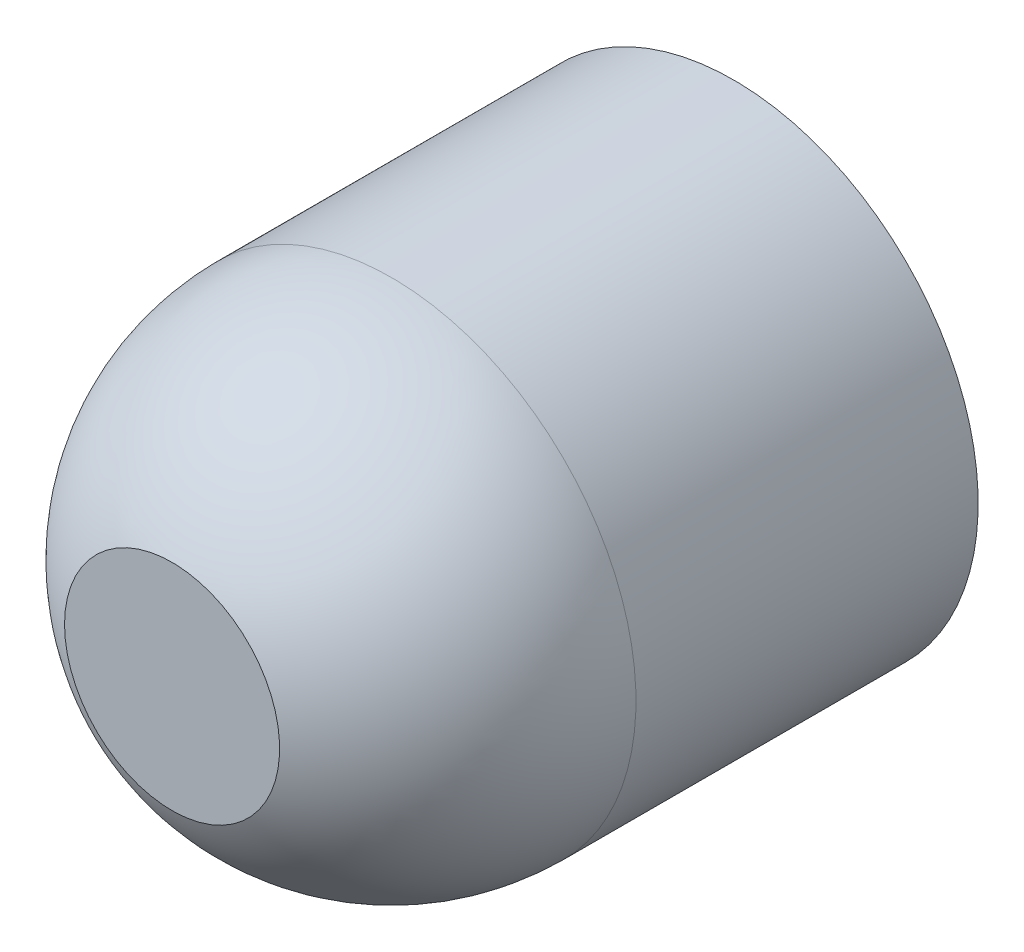
ISO-10303-21;
HEADER;
FILE_DESCRIPTION(('STEP AP214'),'2;1');
FILE_NAME('part.step','',(''),(''),'','','');
FILE_SCHEMA(('AUTOMOTIVE_DESIGN { 1 0 10303 214 1 1 1 1 }'));
ENDSEC;
DATA;
#1=APPLICATION_CONTEXT('core data for automotive mechanical design processes');
#2=APPLICATION_PROTOCOL_DEFINITION('international standard','automotive_design',2000,#1);
#3=PRODUCT_CONTEXT('',#1,'mechanical');
#4=PRODUCT('Part','Part','',(#3));
#5=PRODUCT_RELATED_PRODUCT_CATEGORY('part','',(#4));
#6=PRODUCT_DEFINITION_FORMATION('','',#4);
#7=PRODUCT_DEFINITION_CONTEXT('part definition',#1,'design');
#8=PRODUCT_DEFINITION('design','',#6,#7);
#9=PRODUCT_DEFINITION_SHAPE('','',#8);
#10=(LENGTH_UNIT() NAMED_UNIT(*) SI_UNIT(.MILLI.,.METRE.));
#11=(NAMED_UNIT(*) PLANE_ANGLE_UNIT() SI_UNIT($,.RADIAN.));
#12=(NAMED_UNIT(*) SI_UNIT($,.STERADIAN.) SOLID_ANGLE_UNIT());
#13=UNCERTAINTY_MEASURE_WITH_UNIT(LENGTH_MEASURE(1.E-05),#10,'distance_accuracy_value','');
#14=(GEOMETRIC_REPRESENTATION_CONTEXT(3) GLOBAL_UNCERTAINTY_ASSIGNED_CONTEXT((#13)) GLOBAL_UNIT_ASSIGNED_CONTEXT((#10,
#11,#12)) REPRESENTATION_CONTEXT('',''));
#15=CARTESIAN_POINT('',(0.,0.,0.));
#16=DIRECTION('',(0.,0.,1.));
#17=DIRECTION('',(1.,0.,0.));
#18=AXIS2_PLACEMENT_3D('',#15,#16,#17);
#19=CARTESIAN_POINT('',(0.,0.,0.));
#20=DIRECTION('',(0.,0.,1.));
#21=DIRECTION('',(1.,0.,0.));
#22=AXIS2_PLACEMENT_3D('',#19,#20,#21);
#23=PLANE('',#22);
#24=CARTESIAN_POINT('',(0.,0.,0.));
#25=DIRECTION('',(0.,0.,-1.));
#26=DIRECTION('',(-1.,0.,0.));
#27=AXIS2_PLACEMENT_3D('',#24,#25,#26);
#28=CIRCLE('',#27,12.5);
#29=CARTESIAN_POINT('',(-12.5,0.,0.));
#30=VERTEX_POINT('',#29);
#31=EDGE_CURVE('E35',#30,#30,#28,.T.);
#32=ORIENTED_EDGE('',*,*,#31,.T.);
#33=EDGE_LOOP('',(#32));
#34=FACE_BOUND('',#33,.T.);
#35=ADVANCED_FACE('F29',(#34),#23,.F.);
#36=CARTESIAN_POINT('',(0.,0.,0.));
#37=DIRECTION('',(0.,0.,-1.));
#38=DIRECTION('',(-1.,0.,0.));
#39=AXIS2_PLACEMENT_3D('',#36,#37,#38);
#40=CYLINDRICAL_SURFACE('',#39,12.5);
#41=ORIENTED_EDGE('',*,*,#31,.F.);
#42=EDGE_LOOP('',(#41));
#43=FACE_BOUND('',#42,.T.);
#44=CARTESIAN_POINT('',(0.,0.,17.5));
#45=DIRECTION('',(0.,0.,-1.));
#46=DIRECTION('',(-1.,0.,0.));
#47=AXIS2_PLACEMENT_3D('',#44,#45,#46);
#48=CIRCLE('',#47,12.5);
#49=CARTESIAN_POINT('',(-12.5,0.,17.5));
#50=VERTEX_POINT('',#49);
#51=EDGE_CURVE('E39',#50,#50,#48,.T.);
#52=ORIENTED_EDGE('',*,*,#51,.T.);
#53=EDGE_LOOP('',(#52));
#54=FACE_BOUND('',#53,.T.);
#55=ADVANCED_FACE('F46',(#43,#54),#40,.T.);
#56=CARTESIAN_POINT('',(0.,0.,17.5));
#57=DIRECTION('',(0.,0.,-1.));
#58=DIRECTION('',(-1.,0.,0.));
#59=AXIS2_PLACEMENT_3D('',#56,#57,#58);
#60=SPHERICAL_SURFACE('',#59,12.5);
#61=CARTESIAN_POINT('',(0.,0.,28.7249721603218));
#62=DIRECTION('',(0.,0.,-1.));
#63=DIRECTION('',(-1.,0.,0.));
#64=AXIS2_PLACEMENT_3D('',#61,#62,#63);
#65=CIRCLE('',#64,5.5);
#66=CARTESIAN_POINT('',(-5.5,0.,28.7249721603218));
#67=VERTEX_POINT('',#66);
#68=EDGE_CURVE('E10',#67,#67,#65,.T.);
#69=ORIENTED_EDGE('',*,*,#68,.T.);
#70=EDGE_LOOP('',(#69));
#71=FACE_BOUND('',#70,.T.);
#72=ORIENTED_EDGE('',*,*,#51,.F.);
#73=EDGE_LOOP('',(#72));
#74=FACE_BOUND('',#73,.T.);
#75=ADVANCED_FACE('F48',(#71,#74),#60,.T.);
#76=CARTESIAN_POINT('',(-5.5,-11.8,28.7249721603218));
#77=DIRECTION('',(0.,0.,-1.));
#78=DIRECTION('',(-1.,0.,0.));
#79=AXIS2_PLACEMENT_3D('',#76,#77,#78);
#80=PLANE('',#79);
#81=ORIENTED_EDGE('',*,*,#68,.F.);
#82=EDGE_LOOP('',(#81));
#83=FACE_BOUND('',#82,.T.);
#84=ADVANCED_FACE('F50',(#83),#80,.F.);
#85=CLOSED_SHELL('',(#35,#55,#75,#84));
#86=MANIFOLD_SOLID_BREP('B2',#85);
#87=ADVANCED_BREP_SHAPE_REPRESENTATION('',(#18,#86),#14);
#88=SHAPE_DEFINITION_REPRESENTATION(#9,#87);
ENDSEC;
END-ISO-10303-21;
